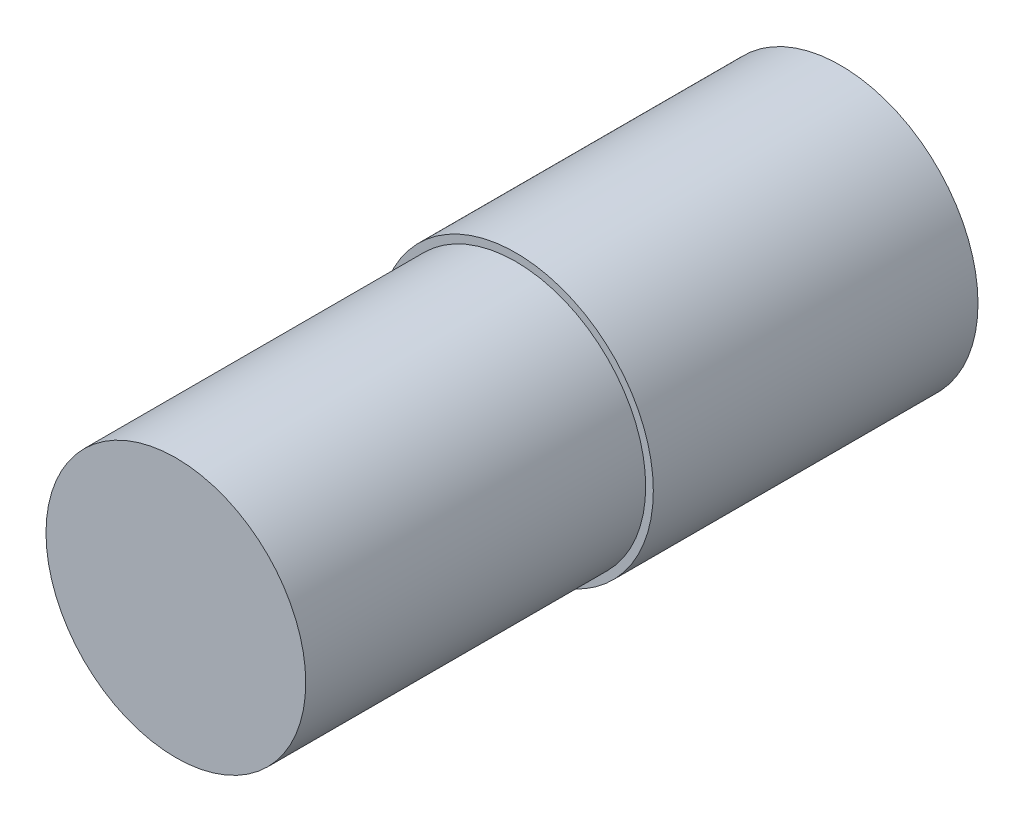
ISO-10303-21;
HEADER;
FILE_DESCRIPTION(('STEP AP214'),'2;1');
FILE_NAME('part.step','',(''),(''),'','','');
FILE_SCHEMA(('AUTOMOTIVE_DESIGN { 1 0 10303 214 1 1 1 1 }'));
ENDSEC;
DATA;
#1=APPLICATION_CONTEXT('core data for automotive mechanical design processes');
#2=APPLICATION_PROTOCOL_DEFINITION('international standard','automotive_design',2000,#1);
#3=PRODUCT_CONTEXT('',#1,'mechanical');
#4=PRODUCT('Part','Part','',(#3));
#5=PRODUCT_RELATED_PRODUCT_CATEGORY('part','',(#4));
#6=PRODUCT_DEFINITION_FORMATION('','',#4);
#7=PRODUCT_DEFINITION_CONTEXT('part definition',#1,'design');
#8=PRODUCT_DEFINITION('design','',#6,#7);
#9=PRODUCT_DEFINITION_SHAPE('','',#8);
#10=(LENGTH_UNIT() NAMED_UNIT(*) SI_UNIT(.MILLI.,.METRE.));
#11=(NAMED_UNIT(*) PLANE_ANGLE_UNIT() SI_UNIT($,.RADIAN.));
#12=(NAMED_UNIT(*) SI_UNIT($,.STERADIAN.) SOLID_ANGLE_UNIT());
#13=UNCERTAINTY_MEASURE_WITH_UNIT(LENGTH_MEASURE(1.E-05),#10,'distance_accuracy_value','');
#14=(GEOMETRIC_REPRESENTATION_CONTEXT(3) GLOBAL_UNCERTAINTY_ASSIGNED_CONTEXT((#13)) GLOBAL_UNIT_ASSIGNED_CONTEXT((#10,
#11,#12)) REPRESENTATION_CONTEXT('',''));
#15=CARTESIAN_POINT('',(0.,0.,0.));
#16=DIRECTION('',(0.,0.,1.));
#17=DIRECTION('',(1.,0.,0.));
#18=AXIS2_PLACEMENT_3D('',#15,#16,#17);
#19=CARTESIAN_POINT('',(0.,0.,42.5));
#20=DIRECTION('',(0.,0.,-1.));
#21=DIRECTION('',(-1.,0.,0.));
#22=AXIS2_PLACEMENT_3D('',#19,#20,#21);
#23=CYLINDRICAL_SURFACE('',#22,18.);
#24=CARTESIAN_POINT('',(0.,0.,42.5));
#25=DIRECTION('',(0.,0.,1.));
#26=DIRECTION('',(1.,0.,0.));
#27=AXIS2_PLACEMENT_3D('',#24,#25,#26);
#28=CIRCLE('',#27,18.);
#29=CARTESIAN_POINT('',(18.,0.,42.5));
#30=VERTEX_POINT('',#29);
#31=EDGE_CURVE('E57',#30,#30,#28,.T.);
#32=ORIENTED_EDGE('',*,*,#31,.F.);
#33=EDGE_LOOP('',(#32));
#34=FACE_BOUND('',#33,.T.);
#35=CARTESIAN_POINT('',(0.,0.,0.));
#36=DIRECTION('',(0.,0.,1.));
#37=DIRECTION('',(1.,0.,0.));
#38=AXIS2_PLACEMENT_3D('',#35,#36,#37);
#39=CIRCLE('',#38,18.);
#40=CARTESIAN_POINT('',(18.,0.,0.));
#41=VERTEX_POINT('',#40);
#42=EDGE_CURVE('E48',#41,#41,#39,.T.);
#43=ORIENTED_EDGE('',*,*,#42,.T.);
#44=EDGE_LOOP('',(#43));
#45=FACE_BOUND('',#44,.T.);
#46=ADVANCED_FACE('F45',(#34,#45),#23,.T.);
#47=CARTESIAN_POINT('',(0.,0.,42.5));
#48=DIRECTION('',(0.,0.,1.));
#49=DIRECTION('',(1.,0.,0.));
#50=AXIS2_PLACEMENT_3D('',#47,#48,#49);
#51=PLANE('',#50);
#52=CARTESIAN_POINT('',(0.,0.,42.5));
#53=DIRECTION('',(0.,0.,1.));
#54=DIRECTION('',(1.,0.,0.));
#55=AXIS2_PLACEMENT_3D('',#52,#53,#54);
#56=CIRCLE('',#55,17.);
#57=CARTESIAN_POINT('',(17.,0.,42.5));
#58=VERTEX_POINT('',#57);
#59=EDGE_CURVE('E52',#58,#58,#56,.T.);
#60=ORIENTED_EDGE('',*,*,#59,.F.);
#61=EDGE_LOOP('',(#60));
#62=FACE_BOUND('',#61,.T.);
#63=ORIENTED_EDGE('',*,*,#31,.T.);
#64=EDGE_LOOP('',(#63));
#65=FACE_BOUND('',#64,.T.);
#66=ADVANCED_FACE('F75',(#62,#65),#51,.T.);
#67=CARTESIAN_POINT('',(0.,0.,0.));
#68=DIRECTION('',(0.,0.,1.));
#69=DIRECTION('',(1.,0.,0.));
#70=AXIS2_PLACEMENT_3D('',#67,#68,#69);
#71=PLANE('',#70);
#72=CARTESIAN_POINT('',(0.,14.,0.));
#73=DIRECTION('',(0.,0.,-1.));
#74=DIRECTION('',(-1.,0.,0.));
#75=AXIS2_PLACEMENT_3D('',#72,#73,#74);
#76=CIRCLE('',#75,1.5);
#77=CARTESIAN_POINT('',(-1.5,14.,0.));
#78=VERTEX_POINT('',#77);
#79=EDGE_CURVE('E215',#78,#78,#76,.T.);
#80=ORIENTED_EDGE('',*,*,#79,.F.);
#81=EDGE_LOOP('',(#80));
#82=FACE_BOUND('',#81,.T.);
#83=CARTESIAN_POINT('',(-14.,-6.42628012313338E-13,0.));
#84=DIRECTION('',(0.,0.,-1.));
#85=DIRECTION('',(-1.,0.,0.));
#86=AXIS2_PLACEMENT_3D('',#83,#84,#85);
#87=CIRCLE('',#86,1.49999999999943);
#88=CARTESIAN_POINT('',(-15.4999999999994,-6.42628012313338E-13,0.));
#89=VERTEX_POINT('',#88);
#90=EDGE_CURVE('E219',#89,#89,#87,.T.);
#91=ORIENTED_EDGE('',*,*,#90,.F.);
#92=EDGE_LOOP('',(#91));
#93=FACE_BOUND('',#92,.T.);
#94=CARTESIAN_POINT('',(1.28525602462668E-12,-14.,0.));
#95=DIRECTION('',(0.,0.,-1.));
#96=DIRECTION('',(-1.,0.,0.));
#97=AXIS2_PLACEMENT_3D('',#94,#95,#96);
#98=CIRCLE('',#97,1.49999999999886);
#99=CARTESIAN_POINT('',(-1.49999999999758,-14.,0.));
#100=VERTEX_POINT('',#99);
#101=EDGE_CURVE('E227',#100,#100,#98,.T.);
#102=ORIENTED_EDGE('',*,*,#101,.F.);
#103=EDGE_LOOP('',(#102));
#104=FACE_BOUND('',#103,.T.);
#105=CARTESIAN_POINT('',(14.,1.92477541247106E-12,0.));
#106=DIRECTION('',(0.,0.,-1.));
#107=DIRECTION('',(-1.,0.,0.));
#108=AXIS2_PLACEMENT_3D('',#105,#106,#107);
#109=CIRCLE('',#108,1.4999999999983);
#110=CARTESIAN_POINT('',(12.5000000000017,1.92477541247106E-12,0.));
#111=VERTEX_POINT('',#110);
#112=EDGE_CURVE('E233',#111,#111,#109,.T.);
#113=ORIENTED_EDGE('',*,*,#112,.F.);
#114=EDGE_LOOP('',(#113));
#115=FACE_BOUND('',#114,.T.);
#116=CARTESIAN_POINT('',(0.,0.,0.));
#117=DIRECTION('',(0.,0.,-1.));
#118=DIRECTION('',(-1.,0.,0.));
#119=AXIS2_PLACEMENT_3D('',#116,#117,#118);
#120=CIRCLE('',#119,11.);
#121=CARTESIAN_POINT('',(-11.,0.,0.));
#122=VERTEX_POINT('',#121);
#123=EDGE_CURVE('E10',#122,#122,#120,.T.);
#124=ORIENTED_EDGE('',*,*,#123,.F.);
#125=EDGE_LOOP('',(#124));
#126=FACE_BOUND('',#125,.T.);
#127=ORIENTED_EDGE('',*,*,#42,.F.);
#128=EDGE_LOOP('',(#127));
#129=FACE_BOUND('',#128,.T.);
#130=ADVANCED_FACE('F72',(#82,#93,#104,#115,#126,#129),#71,.F.);
#131=CARTESIAN_POINT('',(0.,0.,87.));
#132=DIRECTION('',(0.,0.,-1.));
#133=DIRECTION('',(-1.,0.,0.));
#134=AXIS2_PLACEMENT_3D('',#131,#132,#133);
#135=CYLINDRICAL_SURFACE('',#134,17.);
#136=CARTESIAN_POINT('',(0.,0.,87.));
#137=DIRECTION('',(0.,0.,1.));
#138=DIRECTION('',(1.,0.,0.));
#139=AXIS2_PLACEMENT_3D('',#136,#137,#138);
#140=CIRCLE('',#139,17.);
#141=CARTESIAN_POINT('',(17.,0.,87.));
#142=VERTEX_POINT('',#141);
#143=EDGE_CURVE('E63',#142,#142,#140,.T.);
#144=ORIENTED_EDGE('',*,*,#143,.F.);
#145=EDGE_LOOP('',(#144));
#146=FACE_BOUND('',#145,.T.);
#147=ORIENTED_EDGE('',*,*,#59,.T.);
#148=EDGE_LOOP('',(#147));
#149=FACE_BOUND('',#148,.T.);
#150=ADVANCED_FACE('F74',(#146,#149),#135,.T.);
#151=CARTESIAN_POINT('',(0.,0.,87.));
#152=DIRECTION('',(0.,0.,1.));
#153=DIRECTION('',(1.,0.,0.));
#154=AXIS2_PLACEMENT_3D('',#151,#152,#153);
#155=PLANE('',#154);
#156=ORIENTED_EDGE('',*,*,#143,.T.);
#157=EDGE_LOOP('',(#156));
#158=FACE_BOUND('',#157,.T.);
#159=ADVANCED_FACE('F82',(#158),#155,.T.);
#160=CARTESIAN_POINT('',(0.,0.,-2.));
#161=DIRECTION('',(0.,0.,1.));
#162=DIRECTION('',(1.,0.,0.));
#163=AXIS2_PLACEMENT_3D('',#160,#161,#162);
#164=CYLINDRICAL_SURFACE('',#163,11.);
#165=CARTESIAN_POINT('',(0.,0.,-2.));
#166=DIRECTION('',(0.,0.,-1.));
#167=DIRECTION('',(-1.,0.,0.));
#168=AXIS2_PLACEMENT_3D('',#165,#166,#167);
#169=CIRCLE('',#168,11.);
#170=CARTESIAN_POINT('',(-11.,0.,-2.));
#171=VERTEX_POINT('',#170);
#172=EDGE_CURVE('E61',#171,#171,#169,.T.);
#173=ORIENTED_EDGE('',*,*,#172,.F.);
#174=EDGE_LOOP('',(#173));
#175=FACE_BOUND('',#174,.T.);
#176=ORIENTED_EDGE('',*,*,#123,.T.);
#177=EDGE_LOOP('',(#176));
#178=FACE_BOUND('',#177,.T.);
#179=ADVANCED_FACE('F111',(#175,#178),#164,.T.);
#180=CARTESIAN_POINT('',(0.,0.,-2.));
#181=DIRECTION('',(0.,0.,-1.));
#182=DIRECTION('',(-1.,0.,0.));
#183=AXIS2_PLACEMENT_3D('',#180,#181,#182);
#184=PLANE('',#183);
#185=ORIENTED_EDGE('',*,*,#172,.T.);
#186=EDGE_LOOP('',(#185));
#187=FACE_BOUND('',#186,.T.);
#188=ADVANCED_FACE('F119',(#187),#184,.T.);
#189=CARTESIAN_POINT('',(14.,1.92477541247106E-12,5.));
#190=DIRECTION('',(0.,0.,-1.));
#191=DIRECTION('',(-1.,0.,0.));
#192=AXIS2_PLACEMENT_3D('',#189,#190,#191);
#193=CYLINDRICAL_SURFACE('',#192,1.4999999999983);
#194=CARTESIAN_POINT('',(14.,1.92477541247106E-12,5.));
#195=DIRECTION('',(0.,0.,-1.));
#196=DIRECTION('',(-1.,0.,0.));
#197=AXIS2_PLACEMENT_3D('',#194,#195,#196);
#198=CIRCLE('',#197,1.4999999999983);
#199=CARTESIAN_POINT('',(12.5000000000017,1.92477541247106E-12,5.));
#200=VERTEX_POINT('',#199);
#201=EDGE_CURVE('E235',#200,#200,#198,.T.);
#202=ORIENTED_EDGE('',*,*,#201,.F.);
#203=EDGE_LOOP('',(#202));
#204=FACE_BOUND('',#203,.T.);
#205=ORIENTED_EDGE('',*,*,#112,.T.);
#206=EDGE_LOOP('',(#205));
#207=FACE_BOUND('',#206,.T.);
#208=ADVANCED_FACE('F127',(#204,#207),#193,.F.);
#209=CARTESIAN_POINT('',(14.,1.92477541247106E-12,5.));
#210=DIRECTION('',(0.,0.,-1.));
#211=DIRECTION('',(-1.,0.,0.));
#212=AXIS2_PLACEMENT_3D('',#209,#210,#211);
#213=PLANE('',#212);
#214=ORIENTED_EDGE('',*,*,#201,.T.);
#215=EDGE_LOOP('',(#214));
#216=FACE_BOUND('',#215,.T.);
#217=ADVANCED_FACE('F139',(#216),#213,.T.);
#218=CARTESIAN_POINT('',(1.28525602462668E-12,-14.,5.));
#219=DIRECTION('',(0.,0.,-1.));
#220=DIRECTION('',(-1.,0.,0.));
#221=AXIS2_PLACEMENT_3D('',#218,#219,#220);
#222=CYLINDRICAL_SURFACE('',#221,1.49999999999886);
#223=CARTESIAN_POINT('',(1.28525602462668E-12,-14.,5.));
#224=DIRECTION('',(0.,0.,-1.));
#225=DIRECTION('',(-1.,0.,0.));
#226=AXIS2_PLACEMENT_3D('',#223,#224,#225);
#227=CIRCLE('',#226,1.49999999999886);
#228=CARTESIAN_POINT('',(-1.49999999999758,-14.,5.));
#229=VERTEX_POINT('',#228);
#230=EDGE_CURVE('E230',#229,#229,#227,.T.);
#231=ORIENTED_EDGE('',*,*,#230,.F.);
#232=EDGE_LOOP('',(#231));
#233=FACE_BOUND('',#232,.T.);
#234=ORIENTED_EDGE('',*,*,#101,.T.);
#235=EDGE_LOOP('',(#234));
#236=FACE_BOUND('',#235,.T.);
#237=ADVANCED_FACE('F149',(#233,#236),#222,.F.);
#238=CARTESIAN_POINT('',(1.28525602462668E-12,-14.,5.));
#239=DIRECTION('',(0.,0.,-1.));
#240=DIRECTION('',(-1.,0.,0.));
#241=AXIS2_PLACEMENT_3D('',#238,#239,#240);
#242=PLANE('',#241);
#243=ORIENTED_EDGE('',*,*,#230,.T.);
#244=EDGE_LOOP('',(#243));
#245=FACE_BOUND('',#244,.T.);
#246=ADVANCED_FACE('F159',(#245),#242,.T.);
#247=CARTESIAN_POINT('',(-14.,-6.42628012313338E-13,5.));
#248=DIRECTION('',(0.,0.,-1.));
#249=DIRECTION('',(-1.,0.,0.));
#250=AXIS2_PLACEMENT_3D('',#247,#248,#249);
#251=CYLINDRICAL_SURFACE('',#250,1.49999999999943);
#252=CARTESIAN_POINT('',(-14.,-6.42628012313338E-13,5.));
#253=DIRECTION('',(0.,0.,-1.));
#254=DIRECTION('',(-1.,0.,0.));
#255=AXIS2_PLACEMENT_3D('',#252,#253,#254);
#256=CIRCLE('',#255,1.49999999999943);
#257=CARTESIAN_POINT('',(-15.4999999999994,-6.42628012313338E-13,5.));
#258=VERTEX_POINT('',#257);
#259=EDGE_CURVE('E224',#258,#258,#256,.T.);
#260=ORIENTED_EDGE('',*,*,#259,.F.);
#261=EDGE_LOOP('',(#260));
#262=FACE_BOUND('',#261,.T.);
#263=ORIENTED_EDGE('',*,*,#90,.T.);
#264=EDGE_LOOP('',(#263));
#265=FACE_BOUND('',#264,.T.);
#266=ADVANCED_FACE('F169',(#262,#265),#251,.F.);
#267=CARTESIAN_POINT('',(-14.,-6.42628012313338E-13,5.));
#268=DIRECTION('',(0.,0.,-1.));
#269=DIRECTION('',(-1.,0.,0.));
#270=AXIS2_PLACEMENT_3D('',#267,#268,#269);
#271=PLANE('',#270);
#272=ORIENTED_EDGE('',*,*,#259,.T.);
#273=EDGE_LOOP('',(#272));
#274=FACE_BOUND('',#273,.T.);
#275=ADVANCED_FACE('F179',(#274),#271,.T.);
#276=CARTESIAN_POINT('',(0.,14.,5.));
#277=DIRECTION('',(0.,0.,-1.));
#278=DIRECTION('',(-1.,0.,0.));
#279=AXIS2_PLACEMENT_3D('',#276,#277,#278);
#280=CYLINDRICAL_SURFACE('',#279,1.5);
#281=CARTESIAN_POINT('',(0.,14.,5.));
#282=DIRECTION('',(0.,0.,-1.));
#283=DIRECTION('',(-1.,0.,0.));
#284=AXIS2_PLACEMENT_3D('',#281,#282,#283);
#285=CIRCLE('',#284,1.5);
#286=CARTESIAN_POINT('',(-1.5,14.,5.));
#287=VERTEX_POINT('',#286);
#288=EDGE_CURVE('E214',#287,#287,#285,.T.);
#289=ORIENTED_EDGE('',*,*,#288,.F.);
#290=EDGE_LOOP('',(#289));
#291=FACE_BOUND('',#290,.T.);
#292=ORIENTED_EDGE('',*,*,#79,.T.);
#293=EDGE_LOOP('',(#292));
#294=FACE_BOUND('',#293,.T.);
#295=ADVANCED_FACE('F189',(#291,#294),#280,.F.);
#296=CARTESIAN_POINT('',(0.,14.,5.));
#297=DIRECTION('',(0.,0.,-1.));
#298=DIRECTION('',(-1.,0.,0.));
#299=AXIS2_PLACEMENT_3D('',#296,#297,#298);
#300=PLANE('',#299);
#301=ORIENTED_EDGE('',*,*,#288,.T.);
#302=EDGE_LOOP('',(#301));
#303=FACE_BOUND('',#302,.T.);
#304=ADVANCED_FACE('F199',(#303),#300,.T.);
#305=CLOSED_SHELL('',(#46,#66,#130,#150,#159,#179,#188,#208,#217,#237,#246,#266,#275,#295,#304));
#306=MANIFOLD_SOLID_BREP('B2',#305);
#307=ADVANCED_BREP_SHAPE_REPRESENTATION('',(#18,#306),#14);
#308=SHAPE_DEFINITION_REPRESENTATION(#9,#307);
ENDSEC;
END-ISO-10303-21;
